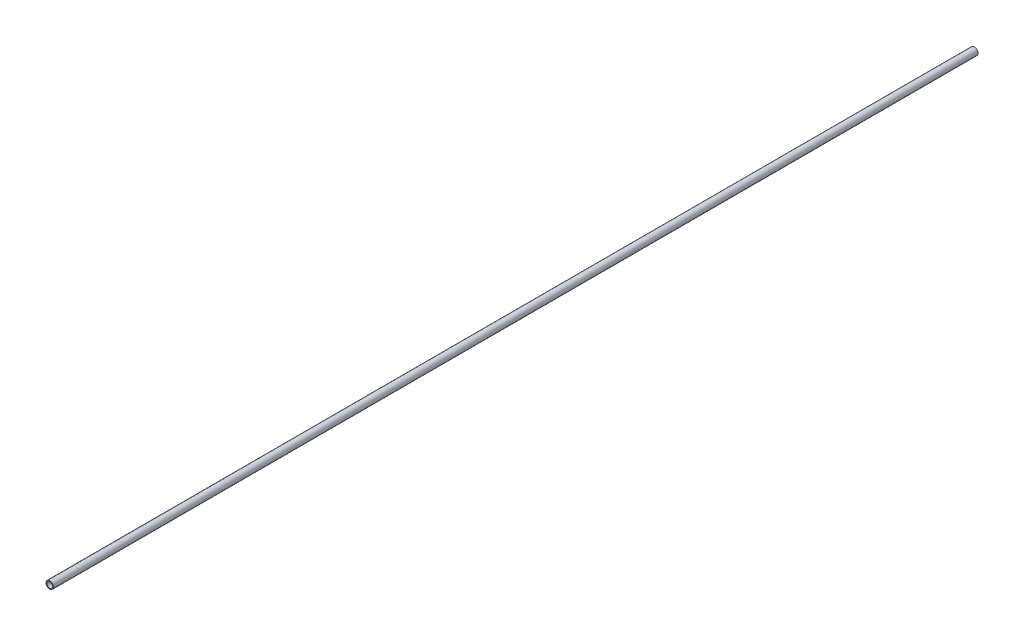
ISO-10303-21;
HEADER;
FILE_DESCRIPTION(('STEP AP214'),'2;1');
FILE_NAME('part.step','',(''),(''),'','','');
FILE_SCHEMA(('AUTOMOTIVE_DESIGN { 1 0 10303 214 1 1 1 1 }'));
ENDSEC;
DATA;
#1=APPLICATION_CONTEXT('core data for automotive mechanical design processes');
#2=APPLICATION_PROTOCOL_DEFINITION('international standard','automotive_design',2000,#1);
#3=PRODUCT_CONTEXT('',#1,'mechanical');
#4=PRODUCT('Part','Part','',(#3));
#5=PRODUCT_RELATED_PRODUCT_CATEGORY('part','',(#4));
#6=PRODUCT_DEFINITION_FORMATION('','',#4);
#7=PRODUCT_DEFINITION_CONTEXT('part definition',#1,'design');
#8=PRODUCT_DEFINITION('design','',#6,#7);
#9=PRODUCT_DEFINITION_SHAPE('','',#8);
#10=(LENGTH_UNIT() NAMED_UNIT(*) SI_UNIT(.MILLI.,.METRE.));
#11=(NAMED_UNIT(*) PLANE_ANGLE_UNIT() SI_UNIT($,.RADIAN.));
#12=(NAMED_UNIT(*) SI_UNIT($,.STERADIAN.) SOLID_ANGLE_UNIT());
#13=UNCERTAINTY_MEASURE_WITH_UNIT(LENGTH_MEASURE(1.E-05),#10,'distance_accuracy_value','');
#14=(GEOMETRIC_REPRESENTATION_CONTEXT(3) GLOBAL_UNCERTAINTY_ASSIGNED_CONTEXT((#13)) GLOBAL_UNIT_ASSIGNED_CONTEXT((#10,
#11,#12)) REPRESENTATION_CONTEXT('',''));
#15=CARTESIAN_POINT('',(0.,0.,0.));
#16=DIRECTION('',(0.,0.,1.));
#17=DIRECTION('',(1.,0.,0.));
#18=AXIS2_PLACEMENT_3D('',#15,#16,#17);
#19=CARTESIAN_POINT('',(0.,0.,500.));
#20=DIRECTION('',(0.,0.,1.));
#21=DIRECTION('',(1.,0.,0.));
#22=AXIS2_PLACEMENT_3D('',#19,#20,#21);
#23=PLANE('',#22);
#24=CARTESIAN_POINT('',(0.,0.,500.));
#25=DIRECTION('',(0.,0.,1.));
#26=DIRECTION('',(1.,0.,0.));
#27=AXIS2_PLACEMENT_3D('',#24,#25,#26);
#28=CIRCLE('',#27,4.);
#29=CARTESIAN_POINT('',(4.,0.,500.));
#30=VERTEX_POINT('',#29);
#31=EDGE_CURVE('E10',#30,#30,#28,.T.);
#32=ORIENTED_EDGE('',*,*,#31,.T.);
#33=EDGE_LOOP('',(#32));
#34=FACE_BOUND('',#33,.T.);
#35=CARTESIAN_POINT('',(0.,0.,500.));
#36=DIRECTION('',(0.,0.,1.));
#37=DIRECTION('',(1.,0.,0.));
#38=AXIS2_PLACEMENT_3D('',#35,#36,#37);
#39=CIRCLE('',#38,3.);
#40=CARTESIAN_POINT('',(3.,0.,500.));
#41=VERTEX_POINT('',#40);
#42=EDGE_CURVE('E50',#41,#41,#39,.T.);
#43=ORIENTED_EDGE('',*,*,#42,.F.);
#44=EDGE_LOOP('',(#43));
#45=FACE_BOUND('',#44,.T.);
#46=ADVANCED_FACE('F37',(#34,#45),#23,.T.);
#47=CARTESIAN_POINT('',(0.,0.,-500.));
#48=DIRECTION('',(0.,0.,1.));
#49=DIRECTION('',(1.,0.,0.));
#50=AXIS2_PLACEMENT_3D('',#47,#48,#49);
#51=PLANE('',#50);
#52=CARTESIAN_POINT('',(0.,0.,-500.));
#53=DIRECTION('',(0.,0.,1.));
#54=DIRECTION('',(1.,0.,0.));
#55=AXIS2_PLACEMENT_3D('',#52,#53,#54);
#56=CIRCLE('',#55,4.);
#57=CARTESIAN_POINT('',(4.,0.,-500.));
#58=VERTEX_POINT('',#57);
#59=EDGE_CURVE('E41',#58,#58,#56,.T.);
#60=ORIENTED_EDGE('',*,*,#59,.F.);
#61=EDGE_LOOP('',(#60));
#62=FACE_BOUND('',#61,.T.);
#63=CARTESIAN_POINT('',(0.,0.,-500.));
#64=DIRECTION('',(0.,0.,1.));
#65=DIRECTION('',(1.,0.,0.));
#66=AXIS2_PLACEMENT_3D('',#63,#64,#65);
#67=CIRCLE('',#66,3.);
#68=CARTESIAN_POINT('',(3.,0.,-500.));
#69=VERTEX_POINT('',#68);
#70=EDGE_CURVE('E52',#69,#69,#67,.T.);
#71=ORIENTED_EDGE('',*,*,#70,.T.);
#72=EDGE_LOOP('',(#71));
#73=FACE_BOUND('',#72,.T.);
#74=ADVANCED_FACE('F64',(#62,#73),#51,.F.);
#75=CARTESIAN_POINT('',(0.,0.,500.));
#76=DIRECTION('',(0.,0.,-1.));
#77=DIRECTION('',(-1.,0.,0.));
#78=AXIS2_PLACEMENT_3D('',#75,#76,#77);
#79=CYLINDRICAL_SURFACE('',#78,4.);
#80=ORIENTED_EDGE('',*,*,#31,.F.);
#81=EDGE_LOOP('',(#80));
#82=FACE_BOUND('',#81,.T.);
#83=ORIENTED_EDGE('',*,*,#59,.T.);
#84=EDGE_LOOP('',(#83));
#85=FACE_BOUND('',#84,.T.);
#86=ADVANCED_FACE('F39',(#82,#85),#79,.T.);
#87=CARTESIAN_POINT('',(0.,0.,500.));
#88=DIRECTION('',(0.,0.,-1.));
#89=DIRECTION('',(-1.,0.,0.));
#90=AXIS2_PLACEMENT_3D('',#87,#88,#89);
#91=CYLINDRICAL_SURFACE('',#90,3.);
#92=ORIENTED_EDGE('',*,*,#42,.T.);
#93=EDGE_LOOP('',(#92));
#94=FACE_BOUND('',#93,.T.);
#95=ORIENTED_EDGE('',*,*,#70,.F.);
#96=EDGE_LOOP('',(#95));
#97=FACE_BOUND('',#96,.T.);
#98=ADVANCED_FACE('F60',(#94,#97),#91,.F.);
#99=CLOSED_SHELL('',(#46,#74,#86,#98));
#100=MANIFOLD_SOLID_BREP('B2',#99);
#101=ADVANCED_BREP_SHAPE_REPRESENTATION('',(#18,#100),#14);
#102=SHAPE_DEFINITION_REPRESENTATION(#9,#101);
ENDSEC;
END-ISO-10303-21;
